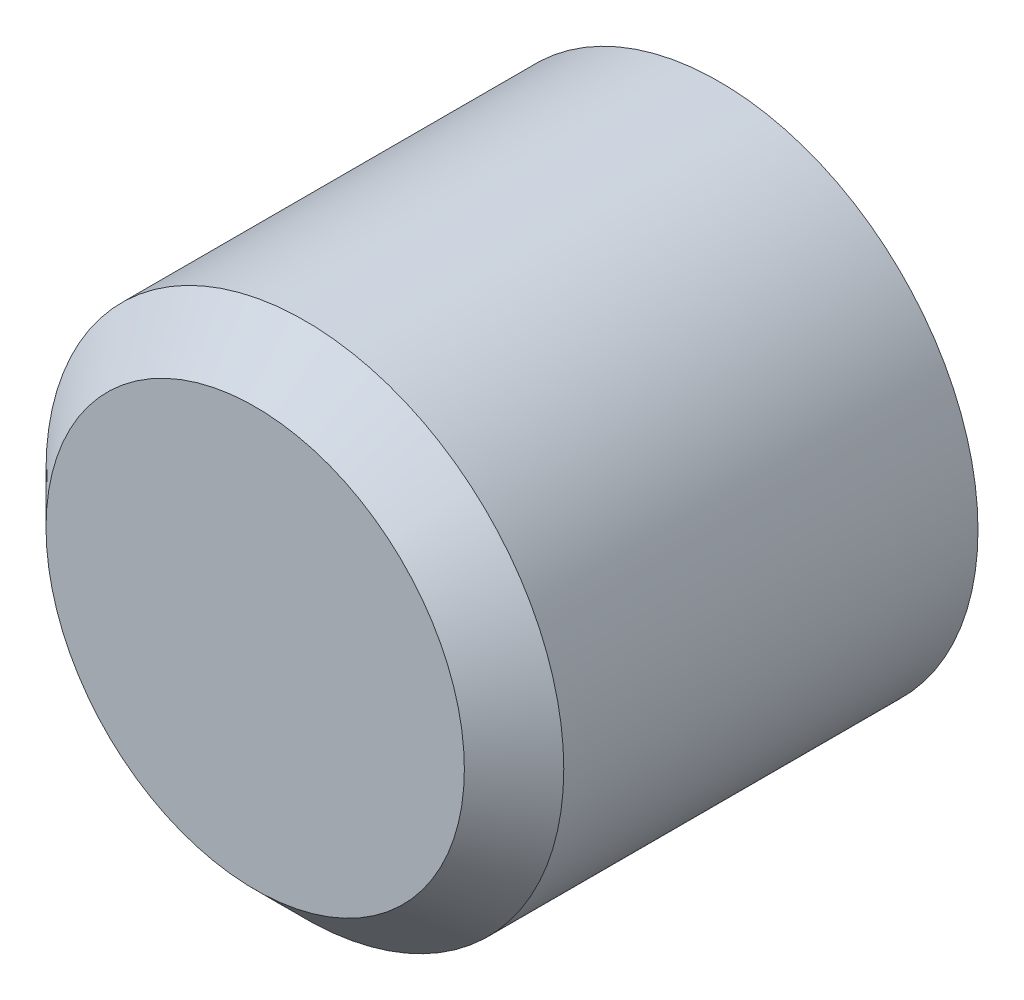
ISO-10303-21;
HEADER;
FILE_DESCRIPTION(('STEP AP214'),'2;1');
FILE_NAME('part.step','',(''),(''),'','','');
FILE_SCHEMA(('AUTOMOTIVE_DESIGN { 1 0 10303 214 1 1 1 1 }'));
ENDSEC;
DATA;
#1=APPLICATION_CONTEXT('core data for automotive mechanical design processes');
#2=APPLICATION_PROTOCOL_DEFINITION('international standard','automotive_design',2000,#1);
#3=PRODUCT_CONTEXT('',#1,'mechanical');
#4=PRODUCT('Part','Part','',(#3));
#5=PRODUCT_RELATED_PRODUCT_CATEGORY('part','',(#4));
#6=PRODUCT_DEFINITION_FORMATION('','',#4);
#7=PRODUCT_DEFINITION_CONTEXT('part definition',#1,'design');
#8=PRODUCT_DEFINITION('design','',#6,#7);
#9=PRODUCT_DEFINITION_SHAPE('','',#8);
#10=(LENGTH_UNIT() NAMED_UNIT(*) SI_UNIT(.MILLI.,.METRE.));
#11=(NAMED_UNIT(*) PLANE_ANGLE_UNIT() SI_UNIT($,.RADIAN.));
#12=(NAMED_UNIT(*) SI_UNIT($,.STERADIAN.) SOLID_ANGLE_UNIT());
#13=UNCERTAINTY_MEASURE_WITH_UNIT(LENGTH_MEASURE(1.E-05),#10,'distance_accuracy_value','');
#14=(GEOMETRIC_REPRESENTATION_CONTEXT(3) GLOBAL_UNCERTAINTY_ASSIGNED_CONTEXT((#13)) GLOBAL_UNIT_ASSIGNED_CONTEXT((#10,
#11,#12)) REPRESENTATION_CONTEXT('',''));
#15=CARTESIAN_POINT('',(0.,0.,0.));
#16=DIRECTION('',(0.,0.,1.));
#17=DIRECTION('',(1.,0.,0.));
#18=AXIS2_PLACEMENT_3D('',#15,#16,#17);
#19=CARTESIAN_POINT('',(31.75,24.13,34.9631));
#20=DIRECTION('',(0.,0.,1.));
#21=DIRECTION('',(1.,0.,0.));
#22=AXIS2_PLACEMENT_3D('',#19,#20,#21);
#23=PLANE('',#22);
#24=CARTESIAN_POINT('',(31.75,24.13,34.9631000000272));
#25=DIRECTION('',(0.,0.,-1.));
#26=DIRECTION('',(-1.,0.,0.));
#27=AXIS2_PLACEMENT_3D('',#24,#25,#26);
#28=CIRCLE('',#27,3.20675000001575);
#29=CARTESIAN_POINT('',(28.5432499999843,24.13,34.9631000000272));
#30=VERTEX_POINT('',#29);
#31=EDGE_CURVE('E52',#30,#30,#28,.T.);
#32=ORIENTED_EDGE('',*,*,#31,.F.);
#33=EDGE_LOOP('',(#32));
#34=FACE_BOUND('',#33,.T.);
#35=ADVANCED_FACE('F37',(#34),#23,.T.);
#36=CARTESIAN_POINT('',(31.75,24.13,34.2011000001321));
#37=DIRECTION('',(0.,0.,-1.));
#38=DIRECTION('',(-1.,0.,0.));
#39=AXIS2_PLACEMENT_3D('',#36,#37,#38);
#40=CONICAL_SURFACE('',#39,3.96874999991087,0.785398163397448);
#41=CARTESIAN_POINT('',(31.75,24.13,34.2011));
#42=DIRECTION('',(0.,0.,1.));
#43=DIRECTION('',(1.,0.,0.));
#44=AXIS2_PLACEMENT_3D('',#41,#42,#43);
#45=CIRCLE('',#44,3.96875);
#46=CARTESIAN_POINT('',(35.71875,24.13,34.2011));
#47=VERTEX_POINT('',#46);
#48=EDGE_CURVE('E48',#47,#47,#45,.F.);
#49=ORIENTED_EDGE('',*,*,#48,.F.);
#50=EDGE_LOOP('',(#49));
#51=FACE_BOUND('',#50,.T.);
#52=ORIENTED_EDGE('',*,*,#31,.T.);
#53=EDGE_LOOP('',(#52));
#54=FACE_BOUND('',#53,.T.);
#55=ADVANCED_FACE('F80',(#51,#54),#40,.T.);
#56=CARTESIAN_POINT('',(31.75,24.13,1.6256));
#57=DIRECTION('',(0.,0.,1.));
#58=DIRECTION('',(1.,0.,0.));
#59=AXIS2_PLACEMENT_3D('',#56,#57,#58);
#60=CYLINDRICAL_SURFACE('',#59,3.96875);
#61=CARTESIAN_POINT('',(31.75,24.13,27.8511));
#62=DIRECTION('',(0.,0.,1.));
#63=DIRECTION('',(1.,0.,0.));
#64=AXIS2_PLACEMENT_3D('',#61,#62,#63);
#65=CIRCLE('',#64,3.96875);
#66=CARTESIAN_POINT('',(35.71875,24.13,27.8511));
#67=VERTEX_POINT('',#66);
#68=EDGE_CURVE('E55',#67,#67,#65,.F.);
#69=ORIENTED_EDGE('',*,*,#68,.F.);
#70=EDGE_LOOP('',(#69));
#71=FACE_BOUND('',#70,.T.);
#72=ORIENTED_EDGE('',*,*,#48,.T.);
#73=EDGE_LOOP('',(#72));
#74=FACE_BOUND('',#73,.T.);
#75=ADVANCED_FACE('F77',(#71,#74),#60,.T.);
#76=CARTESIAN_POINT('',(31.75,24.13,27.8511));
#77=DIRECTION('',(0.,0.,1.));
#78=DIRECTION('',(1.,0.,0.));
#79=AXIS2_PLACEMENT_3D('',#76,#77,#78);
#80=PLANE('',#79);
#81=CARTESIAN_POINT('',(31.75,24.13,27.8511));
#82=DIRECTION('',(0.,0.,1.));
#83=DIRECTION('',(1.,0.,0.));
#84=AXIS2_PLACEMENT_3D('',#81,#82,#83);
#85=CIRCLE('',#84,2.15899999999999);
#86=CARTESIAN_POINT('',(33.909,24.13,27.8511));
#87=VERTEX_POINT('',#86);
#88=EDGE_CURVE('E11',#87,#87,#85,.T.);
#89=ORIENTED_EDGE('',*,*,#88,.T.);
#90=EDGE_LOOP('',(#89));
#91=FACE_BOUND('',#90,.T.);
#92=ORIENTED_EDGE('',*,*,#68,.T.);
#93=EDGE_LOOP('',(#92));
#94=FACE_BOUND('',#93,.T.);
#95=ADVANCED_FACE('F70',(#91,#94),#80,.F.);
#96=CARTESIAN_POINT('',(31.75,24.13,32.9311));
#97=DIRECTION('',(0.,0.,-1.));
#98=DIRECTION('',(-1.,0.,0.));
#99=AXIS2_PLACEMENT_3D('',#96,#97,#98);
#100=CYLINDRICAL_SURFACE('',#99,1.905);
#101=CARTESIAN_POINT('',(31.75,24.13,28.1051));
#102=DIRECTION('',(0.,0.,1.));
#103=DIRECTION('',(1.,0.,0.));
#104=AXIS2_PLACEMENT_3D('',#101,#102,#103);
#105=CIRCLE('',#104,1.905);
#106=CARTESIAN_POINT('',(33.655,24.13,28.1051));
#107=VERTEX_POINT('',#106);
#108=EDGE_CURVE('E44',#107,#107,#105,.F.);
#109=ORIENTED_EDGE('',*,*,#108,.T.);
#110=EDGE_LOOP('',(#109));
#111=FACE_BOUND('',#110,.T.);
#112=CARTESIAN_POINT('',(31.75,24.13,32.9311));
#113=DIRECTION('',(0.,0.,-1.));
#114=DIRECTION('',(-1.,0.,0.));
#115=AXIS2_PLACEMENT_3D('',#112,#113,#114);
#116=CIRCLE('',#115,1.905);
#117=CARTESIAN_POINT('',(29.845,24.13,32.9311));
#118=VERTEX_POINT('',#117);
#119=EDGE_CURVE('E58',#118,#118,#116,.T.);
#120=ORIENTED_EDGE('',*,*,#119,.F.);
#121=EDGE_LOOP('',(#120));
#122=FACE_BOUND('',#121,.T.);
#123=ADVANCED_FACE('F68',(#111,#122),#100,.F.);
#124=CARTESIAN_POINT('',(31.75,24.13,32.9311));
#125=DIRECTION('',(0.,0.,-1.));
#126=DIRECTION('',(-1.,0.,0.));
#127=AXIS2_PLACEMENT_3D('',#124,#125,#126);
#128=PLANE('',#127);
#129=ORIENTED_EDGE('',*,*,#119,.T.);
#130=EDGE_LOOP('',(#129));
#131=FACE_BOUND('',#130,.T.);
#132=ADVANCED_FACE('F66',(#131),#128,.T.);
#133=CARTESIAN_POINT('',(31.75,24.13,28.1051));
#134=DIRECTION('',(0.,0.,-1.));
#135=DIRECTION('',(-1.,0.,0.));
#136=AXIS2_PLACEMENT_3D('',#133,#134,#135);
#137=CONICAL_SURFACE('',#136,1.905,0.785398163397449);
#138=ORIENTED_EDGE('',*,*,#88,.F.);
#139=EDGE_LOOP('',(#138));
#140=FACE_BOUND('',#139,.T.);
#141=ORIENTED_EDGE('',*,*,#108,.F.);
#142=EDGE_LOOP('',(#141));
#143=FACE_BOUND('',#142,.T.);
#144=ADVANCED_FACE('F39',(#140,#143),#137,.F.);
#145=CLOSED_SHELL('',(#35,#55,#75,#95,#123,#132,#144));
#146=MANIFOLD_SOLID_BREP('B2',#145);
#147=ADVANCED_BREP_SHAPE_REPRESENTATION('',(#18,#146),#14);
#148=SHAPE_DEFINITION_REPRESENTATION(#9,#147);
ENDSEC;
END-ISO-10303-21;
